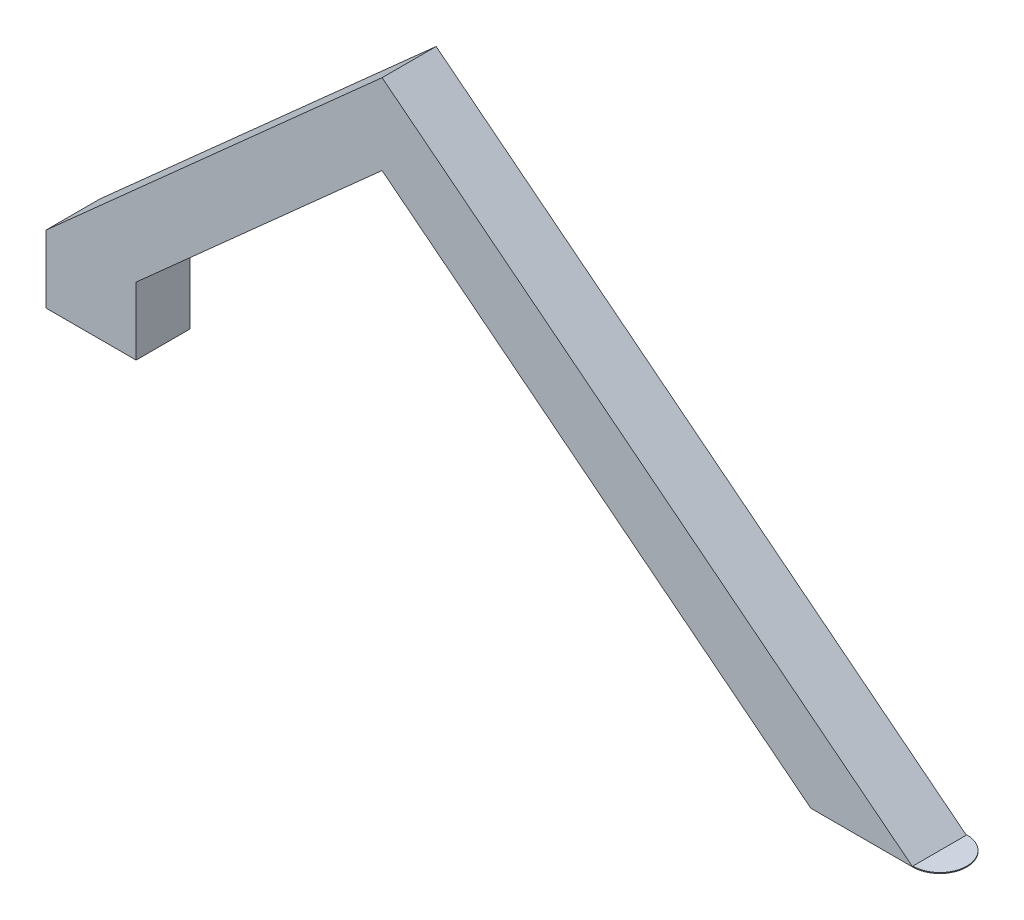
ISO-10303-21;
HEADER;
FILE_DESCRIPTION(('STEP AP214'),'2;1');
FILE_NAME('part.step','',(''),(''),'','','');
FILE_SCHEMA(('AUTOMOTIVE_DESIGN { 1 0 10303 214 1 1 1 1 }'));
ENDSEC;
DATA;
#1=APPLICATION_CONTEXT('core data for automotive mechanical design processes');
#2=APPLICATION_PROTOCOL_DEFINITION('international standard','automotive_design',2000,#1);
#3=PRODUCT_CONTEXT('',#1,'mechanical');
#4=PRODUCT('Part','Part','',(#3));
#5=PRODUCT_RELATED_PRODUCT_CATEGORY('part','',(#4));
#6=PRODUCT_DEFINITION_FORMATION('','',#4);
#7=PRODUCT_DEFINITION_CONTEXT('part definition',#1,'design');
#8=PRODUCT_DEFINITION('design','',#6,#7);
#9=PRODUCT_DEFINITION_SHAPE('','',#8);
#10=(LENGTH_UNIT() NAMED_UNIT(*) SI_UNIT(.MILLI.,.METRE.));
#11=(NAMED_UNIT(*) PLANE_ANGLE_UNIT() SI_UNIT($,.RADIAN.));
#12=(NAMED_UNIT(*) SI_UNIT($,.STERADIAN.) SOLID_ANGLE_UNIT());
#13=UNCERTAINTY_MEASURE_WITH_UNIT(LENGTH_MEASURE(1.E-05),#10,'distance_accuracy_value','');
#14=(GEOMETRIC_REPRESENTATION_CONTEXT(3) GLOBAL_UNCERTAINTY_ASSIGNED_CONTEXT((#13)) GLOBAL_UNIT_ASSIGNED_CONTEXT((#10,
#11,#12)) REPRESENTATION_CONTEXT('',''));
#15=CARTESIAN_POINT('',(0.,0.,0.));
#16=DIRECTION('',(0.,0.,1.));
#17=DIRECTION('',(1.,0.,0.));
#18=AXIS2_PLACEMENT_3D('',#15,#16,#17);
#19=CARTESIAN_POINT('',(182.405421435738,-11.0602195753173,6.));
#20=DIRECTION('',(0.,-1.,0.));
#21=DIRECTION('',(1.,0.,0.));
#22=AXIS2_PLACEMENT_3D('',#19,#20,#21);
#23=CYLINDRICAL_SURFACE('',#22,6.);
#24=CARTESIAN_POINT('',(182.405421435738,-11.2602195753173,6.));
#25=DIRECTION('',(0.,-1.,0.));
#26=DIRECTION('',(-1.,0.,0.));
#27=AXIS2_PLACEMENT_3D('',#24,#25,#26);
#28=CIRCLE('',#27,6.);
#29=CARTESIAN_POINT('',(182.405421435738,-11.2602195753173,0.));
#30=VERTEX_POINT('',#29);
#31=CARTESIAN_POINT('',(182.405421435738,-11.2602195753173,12.));
#32=VERTEX_POINT('',#31);
#33=EDGE_CURVE('E73',#30,#32,#28,.T.);
#34=ORIENTED_EDGE('',*,*,#33,.F.);
#35=DIRECTION('',(0.,-1.,0.));
#36=VECTOR('',#35,1.);
#37=CARTESIAN_POINT('',(182.405421435738,-11.0602195753173,0.));
#38=LINE('',#37,#36);
#39=CARTESIAN_POINT('',(182.405421435738,-11.0602195753173,0.));
#40=VERTEX_POINT('',#39);
#41=EDGE_CURVE('E12',#40,#30,#38,.T.);
#42=ORIENTED_EDGE('',*,*,#41,.F.);
#43=CARTESIAN_POINT('',(182.405421435738,-11.0602195753173,6.));
#44=DIRECTION('',(0.,-1.,0.));
#45=DIRECTION('',(-1.,0.,0.));
#46=AXIS2_PLACEMENT_3D('',#43,#44,#45);
#47=CIRCLE('',#46,6.);
#48=CARTESIAN_POINT('',(182.405421435738,-11.0602195753173,12.));
#49=VERTEX_POINT('',#48);
#50=EDGE_CURVE('E77',#40,#49,#47,.T.);
#51=ORIENTED_EDGE('',*,*,#50,.T.);
#52=DIRECTION('',(0.,-1.,0.));
#53=VECTOR('',#52,1.);
#54=CARTESIAN_POINT('',(182.405421435738,-11.0602195753173,12.));
#55=LINE('',#54,#53);
#56=EDGE_CURVE('E47',#49,#32,#55,.T.);
#57=ORIENTED_EDGE('',*,*,#56,.T.);
#58=EDGE_LOOP('',(#34,#42,#51,#57));
#59=FACE_BOUND('',#58,.T.);
#60=ADVANCED_FACE('F44',(#59),#23,.T.);
#61=CARTESIAN_POINT('',(182.405421435738,-11.0602195753173,12.));
#62=DIRECTION('',(-1.,0.,0.));
#63=DIRECTION('',(0.,-1.,0.));
#64=AXIS2_PLACEMENT_3D('',#61,#62,#63);
#65=PLANE('',#64);
#66=DIRECTION('',(0.,0.,-1.));
#67=VECTOR('',#66,1.);
#68=CARTESIAN_POINT('',(182.405421435738,-11.2602195753173,12.));
#69=LINE('',#68,#67);
#70=EDGE_CURVE('E70',#32,#30,#69,.T.);
#71=ORIENTED_EDGE('',*,*,#70,.F.);
#72=ORIENTED_EDGE('',*,*,#56,.F.);
#73=DIRECTION('',(0.,0.,-1.));
#74=VECTOR('',#73,1.);
#75=CARTESIAN_POINT('',(182.405421435738,-11.0602195753173,12.));
#76=LINE('',#75,#74);
#77=EDGE_CURVE('E72',#49,#40,#76,.T.);
#78=ORIENTED_EDGE('',*,*,#77,.T.);
#79=ORIENTED_EDGE('',*,*,#41,.T.);
#80=EDGE_LOOP('',(#71,#72,#78,#79));
#81=FACE_BOUND('',#80,.T.);
#82=ADVANCED_FACE('F68',(#81),#65,.T.);
#83=CARTESIAN_POINT('',(182.405421435738,-11.0602195753173,6.));
#84=DIRECTION('',(0.,1.,0.));
#85=DIRECTION('',(-1.,0.,0.));
#86=AXIS2_PLACEMENT_3D('',#83,#84,#85);
#87=PLANE('',#86);
#88=ORIENTED_EDGE('',*,*,#50,.F.);
#89=ORIENTED_EDGE('',*,*,#77,.F.);
#90=EDGE_LOOP('',(#88,#89));
#91=FACE_BOUND('',#90,.T.);
#92=ADVANCED_FACE('F82',(#91),#87,.T.);
#93=CARTESIAN_POINT('',(182.405421435738,-11.2602195753173,6.));
#94=DIRECTION('',(0.,1.,0.));
#95=DIRECTION('',(-1.,0.,0.));
#96=AXIS2_PLACEMENT_3D('',#93,#94,#95);
#97=PLANE('',#96);
#98=ORIENTED_EDGE('',*,*,#33,.T.);
#99=ORIENTED_EDGE('',*,*,#70,.T.);
#100=EDGE_LOOP('',(#98,#99));
#101=FACE_BOUND('',#100,.T.);
#102=ADVANCED_FACE('F76',(#101),#97,.F.);
#103=CLOSED_SHELL('',(#60,#82,#92,#102));
#104=MANIFOLD_SOLID_BREP('B2',#103);
#105=CARTESIAN_POINT('',(-10.,0.,12.));
#106=DIRECTION('',(0.,1.,0.));
#107=DIRECTION('',(0.,0.,1.));
#108=AXIS2_PLACEMENT_3D('',#105,#106,#107);
#109=PLANE('',#108);
#110=CARTESIAN_POINT('',(0.,0.,6.));
#111=DIRECTION('',(0.,-1.,0.));
#112=DIRECTION('',(0.,0.,-1.));
#113=AXIS2_PLACEMENT_3D('',#110,#111,#112);
#114=CIRCLE('',#113,1.);
#115=CARTESIAN_POINT('',(0.,0.,5.));
#116=VERTEX_POINT('',#115);
#117=EDGE_CURVE('E259',#116,#116,#114,.T.);
#118=ORIENTED_EDGE('',*,*,#117,.F.);
#119=EDGE_LOOP('',(#118));
#120=FACE_BOUND('',#119,.T.);
#121=DIRECTION('',(1.,0.,0.));
#122=VECTOR('',#121,1.);
#123=CARTESIAN_POINT('',(-10.,0.,0.));
#124=LINE('',#123,#122);
#125=CARTESIAN_POINT('',(-10.,0.,0.));
#126=VERTEX_POINT('',#125);
#127=CARTESIAN_POINT('',(10.,0.,0.));
#128=VERTEX_POINT('',#127);
#129=EDGE_CURVE('E211',#126,#128,#124,.T.);
#130=ORIENTED_EDGE('',*,*,#129,.T.);
#131=DIRECTION('',(0.,0.,-1.));
#132=VECTOR('',#131,1.);
#133=CARTESIAN_POINT('',(10.,0.,12.));
#134=LINE('',#133,#132);
#135=CARTESIAN_POINT('',(10.,0.,12.));
#136=VERTEX_POINT('',#135);
#137=EDGE_CURVE('E42',#136,#128,#134,.T.);
#138=ORIENTED_EDGE('',*,*,#137,.F.);
#139=DIRECTION('',(1.,0.,0.));
#140=VECTOR('',#139,1.);
#141=CARTESIAN_POINT('',(-10.,0.,12.));
#142=LINE('',#141,#140);
#143=CARTESIAN_POINT('',(-10.,0.,12.));
#144=VERTEX_POINT('',#143);
#145=EDGE_CURVE('E226',#144,#136,#142,.T.);
#146=ORIENTED_EDGE('',*,*,#145,.F.);
#147=DIRECTION('',(0.,0.,-1.));
#148=VECTOR('',#147,1.);
#149=CARTESIAN_POINT('',(-10.,0.,12.));
#150=LINE('',#149,#148);
#151=EDGE_CURVE('E207',#144,#126,#150,.T.);
#152=ORIENTED_EDGE('',*,*,#151,.T.);
#153=EDGE_LOOP('',(#130,#138,#146,#152));
#154=FACE_BOUND('',#153,.T.);
#155=ADVANCED_FACE('F115',(#120,#154),#109,.F.);
#156=CARTESIAN_POINT('',(10.,0.,12.));
#157=DIRECTION('',(-1.,0.,0.));
#158=DIRECTION('',(0.,0.,1.));
#159=AXIS2_PLACEMENT_3D('',#156,#157,#158);
#160=PLANE('',#159);
#161=DIRECTION('',(0.,1.,0.));
#162=VECTOR('',#161,1.);
#163=CARTESIAN_POINT('',(10.,0.,0.));
#164=LINE('',#163,#162);
#165=CARTESIAN_POINT('',(10.,15.,0.));
#166=VERTEX_POINT('',#165);
#167=EDGE_CURVE('E214',#128,#166,#164,.T.);
#168=ORIENTED_EDGE('',*,*,#167,.T.);
#169=DIRECTION('',(0.,0.,-1.));
#170=VECTOR('',#169,1.);
#171=CARTESIAN_POINT('',(10.,15.,12.));
#172=LINE('',#171,#170);
#173=CARTESIAN_POINT('',(10.,15.,12.));
#174=VERTEX_POINT('',#173);
#175=EDGE_CURVE('E123',#174,#166,#172,.T.);
#176=ORIENTED_EDGE('',*,*,#175,.F.);
#177=DIRECTION('',(0.,1.,0.));
#178=VECTOR('',#177,1.);
#179=CARTESIAN_POINT('',(10.,0.,12.));
#180=LINE('',#179,#178);
#181=EDGE_CURVE('E174',#136,#174,#180,.T.);
#182=ORIENTED_EDGE('',*,*,#181,.F.);
#183=ORIENTED_EDGE('',*,*,#137,.T.);
#184=EDGE_LOOP('',(#168,#176,#182,#183));
#185=FACE_BOUND('',#184,.T.);
#186=ADVANCED_FACE('F275',(#185),#160,.F.);
#187=CARTESIAN_POINT('',(10.,15.,12.));
#188=DIRECTION('',(-0.665942565430712,0.746003015776452,0.));
#189=DIRECTION('',(-0.746003015776452,-0.665942565430712,0.));
#190=AXIS2_PLACEMENT_3D('',#187,#188,#189);
#191=PLANE('',#190);
#192=DIRECTION('',(0.746003015776452,0.665942565430713,0.));
#193=VECTOR('',#192,1.);
#194=CARTESIAN_POINT('',(10.,15.,0.));
#195=LINE('',#194,#193);
#196=CARTESIAN_POINT('',(64.6003015776452,63.7406406367712,0.));
#197=VERTEX_POINT('',#196);
#198=EDGE_CURVE('E217',#166,#197,#195,.T.);
#199=ORIENTED_EDGE('',*,*,#198,.T.);
#200=DIRECTION('',(0.,0.,-1.));
#201=VECTOR('',#200,1.);
#202=CARTESIAN_POINT('',(64.6003015776452,63.7406406367712,12.));
#203=LINE('',#202,#201);
#204=CARTESIAN_POINT('',(64.6003015776452,63.7406406367712,12.));
#205=VERTEX_POINT('',#204);
#206=EDGE_CURVE('E233',#205,#197,#203,.T.);
#207=ORIENTED_EDGE('',*,*,#206,.F.);
#208=DIRECTION('',(0.746003015776452,0.665942565430713,0.));
#209=VECTOR('',#208,1.);
#210=CARTESIAN_POINT('',(10.,15.,12.));
#211=LINE('',#210,#209);
#212=EDGE_CURVE('E241',#174,#205,#211,.T.);
#213=ORIENTED_EDGE('',*,*,#212,.F.);
#214=ORIENTED_EDGE('',*,*,#175,.T.);
#215=EDGE_LOOP('',(#199,#207,#213,#214));
#216=FACE_BOUND('',#215,.T.);
#217=ADVANCED_FACE('F239',(#216),#191,.F.);
#218=CARTESIAN_POINT('',(64.6003015776452,63.7406406367712,12.));
#219=DIRECTION('',(0.619029840789257,0.785367465720618,0.));
#220=DIRECTION('',(-0.785367465720619,0.619029840789257,0.));
#221=AXIS2_PLACEMENT_3D('',#218,#219,#220);
#222=PLANE('',#221);
#223=DIRECTION('',(0.785367465720618,-0.619029840789257,0.));
#224=VECTOR('',#223,1.);
#225=CARTESIAN_POINT('',(64.6003015776452,63.7406406367712,0.));
#226=LINE('',#225,#224);
#227=CARTESIAN_POINT('',(159.754414724329,-11.2602195753173,0.));
#228=VERTEX_POINT('',#227);
#229=EDGE_CURVE('E219',#197,#228,#226,.T.);
#230=ORIENTED_EDGE('',*,*,#229,.T.);
#231=DIRECTION('',(0.,0.,-1.));
#232=VECTOR('',#231,1.);
#233=CARTESIAN_POINT('',(159.754414724329,-11.2602195753173,12.));
#234=LINE('',#233,#232);
#235=CARTESIAN_POINT('',(159.754414724329,-11.2602195753173,12.));
#236=VERTEX_POINT('',#235);
#237=EDGE_CURVE('E230',#236,#228,#234,.T.);
#238=ORIENTED_EDGE('',*,*,#237,.F.);
#239=DIRECTION('',(0.785367465720618,-0.619029840789257,0.));
#240=VECTOR('',#239,1.);
#241=CARTESIAN_POINT('',(64.6003015776452,63.7406406367712,12.));
#242=LINE('',#241,#240);
#243=EDGE_CURVE('E253',#205,#236,#242,.T.);
#244=ORIENTED_EDGE('',*,*,#243,.F.);
#245=ORIENTED_EDGE('',*,*,#206,.T.);
#246=EDGE_LOOP('',(#230,#238,#244,#245));
#247=FACE_BOUND('',#246,.T.);
#248=ADVANCED_FACE('F249',(#247),#222,.F.);
#249=CARTESIAN_POINT('',(159.754414724329,-11.2602195753173,12.));
#250=DIRECTION('',(0.,1.,0.));
#251=DIRECTION('',(0.,0.,1.));
#252=AXIS2_PLACEMENT_3D('',#249,#250,#251);
#253=PLANE('',#252);
#254=DIRECTION('',(1.,0.,0.));
#255=VECTOR('',#254,1.);
#256=CARTESIAN_POINT('',(159.754414724329,-11.2602195753173,0.));
#257=LINE('',#256,#255);
#258=CARTESIAN_POINT('',(182.405421435738,-11.2602195753173,0.));
#259=VERTEX_POINT('',#258);
#260=EDGE_CURVE('E221',#228,#259,#257,.T.);
#261=ORIENTED_EDGE('',*,*,#260,.T.);
#262=DIRECTION('',(0.,0.,-1.));
#263=VECTOR('',#262,1.);
#264=CARTESIAN_POINT('',(182.405421435738,-11.2602195753173,12.));
#265=LINE('',#264,#263);
#266=CARTESIAN_POINT('',(182.405421435738,-11.2602195753173,12.));
#267=VERTEX_POINT('',#266);
#268=EDGE_CURVE('E202',#267,#259,#265,.T.);
#269=ORIENTED_EDGE('',*,*,#268,.F.);
#270=DIRECTION('',(1.,0.,0.));
#271=VECTOR('',#270,1.);
#272=CARTESIAN_POINT('',(159.754414724329,-11.2602195753173,12.));
#273=LINE('',#272,#271);
#274=EDGE_CURVE('E193',#236,#267,#273,.T.);
#275=ORIENTED_EDGE('',*,*,#274,.F.);
#276=ORIENTED_EDGE('',*,*,#237,.T.);
#277=EDGE_LOOP('',(#261,#269,#275,#276));
#278=FACE_BOUND('',#277,.T.);
#279=ADVANCED_FACE('F252',(#278),#253,.F.);
#280=CARTESIAN_POINT('',(64.6003015776452,81.5942565430713,12.));
#281=DIRECTION('',(-0.619029840789257,-0.785367465720618,0.));
#282=DIRECTION('',(0.785367465720618,-0.619029840789257,0.));
#283=AXIS2_PLACEMENT_3D('',#280,#281,#282);
#284=PLANE('',#283);
#285=DIRECTION('',(-0.785367465720618,0.619029840789257,0.));
#286=VECTOR('',#285,1.);
#287=CARTESIAN_POINT('',(64.6003015776452,81.5942565430713,0.));
#288=LINE('',#287,#286);
#289=CARTESIAN_POINT('',(64.6003015776452,81.5942565430713,0.));
#290=VERTEX_POINT('',#289);
#291=EDGE_CURVE('E201',#259,#290,#288,.T.);
#292=ORIENTED_EDGE('',*,*,#291,.T.);
#293=DIRECTION('',(0.,0.,-1.));
#294=VECTOR('',#293,1.);
#295=CARTESIAN_POINT('',(64.6003015776452,81.5942565430713,12.));
#296=LINE('',#295,#294);
#297=CARTESIAN_POINT('',(64.6003015776452,81.5942565430713,12.));
#298=VERTEX_POINT('',#297);
#299=EDGE_CURVE('E198',#298,#290,#296,.T.);
#300=ORIENTED_EDGE('',*,*,#299,.F.);
#301=DIRECTION('',(-0.785367465720618,0.619029840789257,0.));
#302=VECTOR('',#301,1.);
#303=CARTESIAN_POINT('',(64.6003015776452,81.5942565430713,12.));
#304=LINE('',#303,#302);
#305=EDGE_CURVE('E187',#267,#298,#304,.T.);
#306=ORIENTED_EDGE('',*,*,#305,.F.);
#307=ORIENTED_EDGE('',*,*,#268,.T.);
#308=EDGE_LOOP('',(#292,#300,#306,#307));
#309=FACE_BOUND('',#308,.T.);
#310=ADVANCED_FACE('F199',(#309),#284,.F.);
#311=CARTESIAN_POINT('',(-10.,15.,12.));
#312=DIRECTION('',(0.665942565430713,-0.746003015776452,0.));
#313=DIRECTION('',(0.746003015776452,0.665942565430713,0.));
#314=AXIS2_PLACEMENT_3D('',#311,#312,#313);
#315=PLANE('',#314);
#316=DIRECTION('',(-0.746003015776452,-0.665942565430713,0.));
#317=VECTOR('',#316,1.);
#318=CARTESIAN_POINT('',(-10.,15.,0.));
#319=LINE('',#318,#317);
#320=CARTESIAN_POINT('',(-10.,15.,0.));
#321=VERTEX_POINT('',#320);
#322=EDGE_CURVE('E160',#290,#321,#319,.T.);
#323=ORIENTED_EDGE('',*,*,#322,.T.);
#324=DIRECTION('',(0.,0.,-1.));
#325=VECTOR('',#324,1.);
#326=CARTESIAN_POINT('',(-10.,15.,12.));
#327=LINE('',#326,#325);
#328=CARTESIAN_POINT('',(-10.,15.,12.));
#329=VERTEX_POINT('',#328);
#330=EDGE_CURVE('E203',#329,#321,#327,.T.);
#331=ORIENTED_EDGE('',*,*,#330,.F.);
#332=DIRECTION('',(-0.746003015776452,-0.665942565430713,0.));
#333=VECTOR('',#332,1.);
#334=CARTESIAN_POINT('',(-10.,15.,12.));
#335=LINE('',#334,#333);
#336=EDGE_CURVE('E191',#298,#329,#335,.T.);
#337=ORIENTED_EDGE('',*,*,#336,.F.);
#338=ORIENTED_EDGE('',*,*,#299,.T.);
#339=EDGE_LOOP('',(#323,#331,#337,#338));
#340=FACE_BOUND('',#339,.T.);
#341=ADVANCED_FACE('F205',(#340),#315,.F.);
#342=CARTESIAN_POINT('',(-10.,0.,12.));
#343=DIRECTION('',(1.,0.,0.));
#344=DIRECTION('',(0.,0.,-1.));
#345=AXIS2_PLACEMENT_3D('',#342,#343,#344);
#346=PLANE('',#345);
#347=DIRECTION('',(0.,-1.,0.));
#348=VECTOR('',#347,1.);
#349=CARTESIAN_POINT('',(-10.,0.,0.));
#350=LINE('',#349,#348);
#351=EDGE_CURVE('E166',#321,#126,#350,.T.);
#352=ORIENTED_EDGE('',*,*,#351,.T.);
#353=ORIENTED_EDGE('',*,*,#151,.F.);
#354=DIRECTION('',(0.,-1.,0.));
#355=VECTOR('',#354,1.);
#356=CARTESIAN_POINT('',(-10.,0.,12.));
#357=LINE('',#356,#355);
#358=EDGE_CURVE('E131',#329,#144,#357,.T.);
#359=ORIENTED_EDGE('',*,*,#358,.F.);
#360=ORIENTED_EDGE('',*,*,#330,.T.);
#361=EDGE_LOOP('',(#352,#353,#359,#360));
#362=FACE_BOUND('',#361,.T.);
#363=ADVANCED_FACE('F278',(#362),#346,.F.);
#364=CARTESIAN_POINT('',(0.,0.,12.));
#365=DIRECTION('',(0.,0.,1.));
#366=DIRECTION('',(1.,0.,0.));
#367=AXIS2_PLACEMENT_3D('',#364,#365,#366);
#368=PLANE('',#367);
#369=ORIENTED_EDGE('',*,*,#145,.T.);
#370=ORIENTED_EDGE('',*,*,#181,.T.);
#371=ORIENTED_EDGE('',*,*,#212,.T.);
#372=ORIENTED_EDGE('',*,*,#243,.T.);
#373=ORIENTED_EDGE('',*,*,#274,.T.);
#374=ORIENTED_EDGE('',*,*,#305,.T.);
#375=ORIENTED_EDGE('',*,*,#336,.T.);
#376=ORIENTED_EDGE('',*,*,#358,.T.);
#377=EDGE_LOOP('',(#369,#370,#371,#372,#373,#374,#375,#376));
#378=FACE_BOUND('',#377,.T.);
#379=ADVANCED_FACE('F189',(#378),#368,.T.);
#380=CARTESIAN_POINT('',(0.,0.,0.));
#381=DIRECTION('',(0.,0.,1.));
#382=DIRECTION('',(1.,0.,0.));
#383=AXIS2_PLACEMENT_3D('',#380,#381,#382);
#384=PLANE('',#383);
#385=ORIENTED_EDGE('',*,*,#129,.F.);
#386=ORIENTED_EDGE('',*,*,#351,.F.);
#387=ORIENTED_EDGE('',*,*,#322,.F.);
#388=ORIENTED_EDGE('',*,*,#291,.F.);
#389=ORIENTED_EDGE('',*,*,#260,.F.);
#390=ORIENTED_EDGE('',*,*,#229,.F.);
#391=ORIENTED_EDGE('',*,*,#198,.F.);
#392=ORIENTED_EDGE('',*,*,#167,.F.);
#393=EDGE_LOOP('',(#385,#386,#387,#388,#389,#390,#391,#392));
#394=FACE_BOUND('',#393,.T.);
#395=ADVANCED_FACE('F245',(#394),#384,.F.);
#396=CARTESIAN_POINT('',(0.,1.,6.));
#397=DIRECTION('',(0.,-1.,0.));
#398=DIRECTION('',(0.,0.,-1.));
#399=AXIS2_PLACEMENT_3D('',#396,#397,#398);
#400=CYLINDRICAL_SURFACE('',#399,1.);
#401=CARTESIAN_POINT('',(0.,1.,6.));
#402=DIRECTION('',(0.,-1.,0.));
#403=DIRECTION('',(0.,0.,-1.));
#404=AXIS2_PLACEMENT_3D('',#401,#402,#403);
#405=CIRCLE('',#404,1.);
#406=CARTESIAN_POINT('',(0.,1.,5.));
#407=VERTEX_POINT('',#406);
#408=EDGE_CURVE('E215',#407,#407,#405,.T.);
#409=ORIENTED_EDGE('',*,*,#408,.F.);
#410=EDGE_LOOP('',(#409));
#411=FACE_BOUND('',#410,.T.);
#412=ORIENTED_EDGE('',*,*,#117,.T.);
#413=EDGE_LOOP('',(#412));
#414=FACE_BOUND('',#413,.T.);
#415=ADVANCED_FACE('F267',(#411,#414),#400,.F.);
#416=CARTESIAN_POINT('',(0.,1.,6.));
#417=DIRECTION('',(0.,-1.,0.));
#418=DIRECTION('',(0.,0.,-1.));
#419=AXIS2_PLACEMENT_3D('',#416,#417,#418);
#420=PLANE('',#419);
#421=ORIENTED_EDGE('',*,*,#408,.T.);
#422=EDGE_LOOP('',(#421));
#423=FACE_BOUND('',#422,.T.);
#424=ADVANCED_FACE('F265',(#423),#420,.T.);
#425=CLOSED_SHELL('',(#155,#186,#217,#248,#279,#310,#341,#363,#379,#395,#415,#424));
#426=MANIFOLD_SOLID_BREP('B6',#425);
#427=ADVANCED_BREP_SHAPE_REPRESENTATION('',(#18,#104,#426),#14);
#428=SHAPE_DEFINITION_REPRESENTATION(#9,#427);
ENDSEC;
END-ISO-10303-21;
